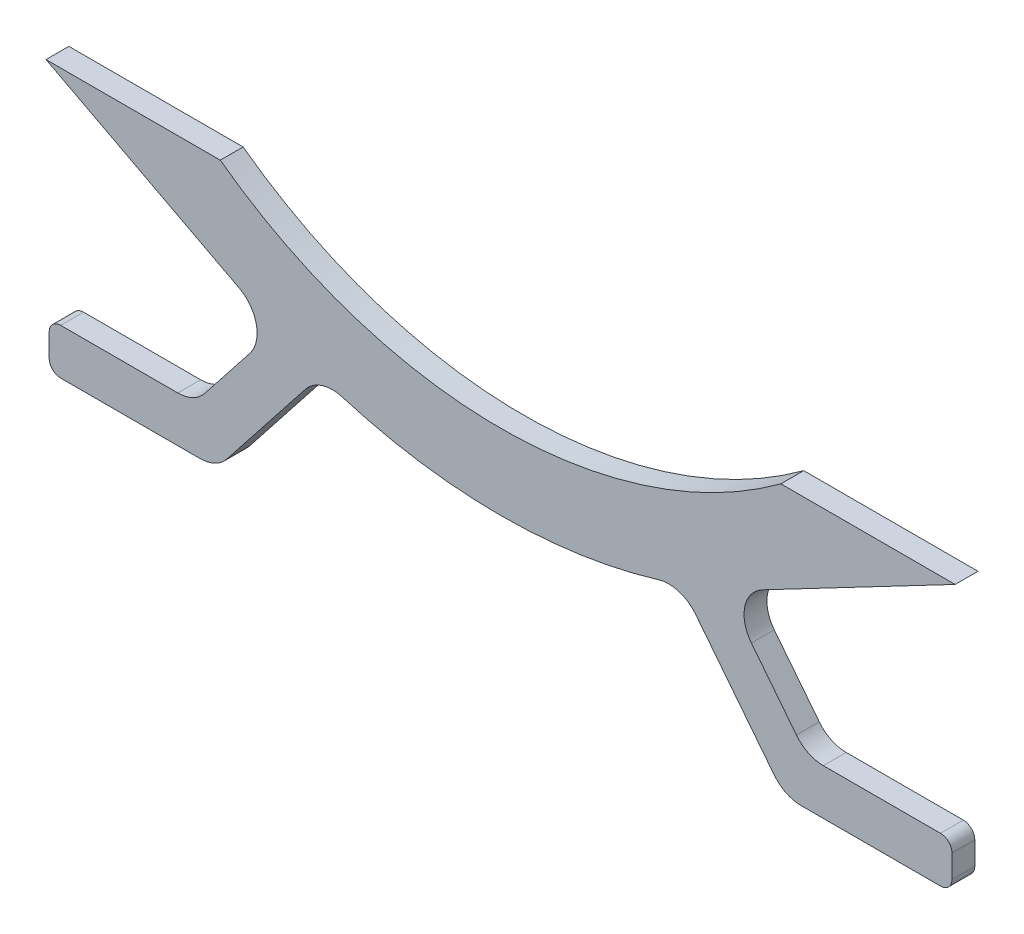
ISO-10303-21;
HEADER;
FILE_DESCRIPTION(('STEP AP214'),'2;1');
FILE_NAME('part.step','',(''),(''),'','','');
FILE_SCHEMA(('AUTOMOTIVE_DESIGN { 1 0 10303 214 1 1 1 1 }'));
ENDSEC;
DATA;
#1=APPLICATION_CONTEXT('core data for automotive mechanical design processes');
#2=APPLICATION_PROTOCOL_DEFINITION('international standard','automotive_design',2000,#1);
#3=PRODUCT_CONTEXT('',#1,'mechanical');
#4=PRODUCT('Part','Part','',(#3));
#5=PRODUCT_RELATED_PRODUCT_CATEGORY('part','',(#4));
#6=PRODUCT_DEFINITION_FORMATION('','',#4);
#7=PRODUCT_DEFINITION_CONTEXT('part definition',#1,'design');
#8=PRODUCT_DEFINITION('design','',#6,#7);
#9=PRODUCT_DEFINITION_SHAPE('','',#8);
#10=(LENGTH_UNIT() NAMED_UNIT(*) SI_UNIT(.MILLI.,.METRE.));
#11=(NAMED_UNIT(*) PLANE_ANGLE_UNIT() SI_UNIT($,.RADIAN.));
#12=(NAMED_UNIT(*) SI_UNIT($,.STERADIAN.) SOLID_ANGLE_UNIT());
#13=UNCERTAINTY_MEASURE_WITH_UNIT(LENGTH_MEASURE(1.E-05),#10,'distance_accuracy_value','');
#14=(GEOMETRIC_REPRESENTATION_CONTEXT(3) GLOBAL_UNCERTAINTY_ASSIGNED_CONTEXT((#13)) GLOBAL_UNIT_ASSIGNED_CONTEXT((#10,
#11,#12)) REPRESENTATION_CONTEXT('',''));
#15=CARTESIAN_POINT('',(0.,0.,0.));
#16=DIRECTION('',(0.,0.,1.));
#17=DIRECTION('',(1.,0.,0.));
#18=AXIS2_PLACEMENT_3D('',#15,#16,#17);
#19=CARTESIAN_POINT('',(31.674047274541,-39.6707775653773,3.175));
#20=DIRECTION('',(0.,0.,-1.));
#21=DIRECTION('',(-1.,0.,0.));
#22=AXIS2_PLACEMENT_3D('',#19,#20,#21);
#23=CYLINDRICAL_SURFACE('',#22,9.525);
#24=DIRECTION('',(0.,0.,-1.));
#25=VECTOR('',#24,1.);
#26=CARTESIAN_POINT('',(36.5718227165431,-31.5014801219174,3.175));
#27=LINE('',#26,#25);
#28=CARTESIAN_POINT('',(36.5718227165431,-31.5014801219174,-3.175));
#29=VERTEX_POINT('',#28);
#30=CARTESIAN_POINT('',(36.5718227165431,-31.5014801219174,3.175));
#31=VERTEX_POINT('',#30);
#32=EDGE_CURVE('E376',#29,#31,#27,.F.);
#33=ORIENTED_EDGE('',*,*,#32,.F.);
#34=CARTESIAN_POINT('',(31.674047274541,-39.6707775653773,-3.175));
#35=DIRECTION('',(0.,0.,-1.));
#36=DIRECTION('',(-1.,0.,0.));
#37=AXIS2_PLACEMENT_3D('',#34,#35,#36);
#38=CIRCLE('',#37,9.525);
#39=CARTESIAN_POINT('',(39.1571945715694,-45.5638354754081,-3.175));
#40=VERTEX_POINT('',#39);
#41=EDGE_CURVE('E234',#40,#29,#38,.F.);
#42=ORIENTED_EDGE('',*,*,#41,.F.);
#43=DIRECTION('',(0.,0.,-1.));
#44=VECTOR('',#43,1.);
#45=CARTESIAN_POINT('',(39.1571945715694,-45.5638354754081,89.1269852469976));
#46=LINE('',#45,#44);
#47=CARTESIAN_POINT('',(39.1571945715694,-45.5638354754081,3.175));
#48=VERTEX_POINT('',#47);
#49=EDGE_CURVE('E326',#48,#40,#46,.T.);
#50=ORIENTED_EDGE('',*,*,#49,.F.);
#51=CARTESIAN_POINT('',(31.674047274541,-39.6707775653773,3.175));
#52=DIRECTION('',(0.,0.,-1.));
#53=DIRECTION('',(-1.,0.,0.));
#54=AXIS2_PLACEMENT_3D('',#51,#52,#53);
#55=CIRCLE('',#54,9.525);
#56=EDGE_CURVE('E348',#31,#48,#55,.T.);
#57=ORIENTED_EDGE('',*,*,#56,.F.);
#58=EDGE_LOOP('',(#33,#42,#50,#57));
#59=FACE_BOUND('',#58,.T.);
#60=ADVANCED_FACE('F31',(#59),#23,.F.);
#61=CARTESIAN_POINT('',(108.839,102.685380348068,3.175));
#62=DIRECTION('',(0.,0.,-1.));
#63=DIRECTION('',(-1.,0.,0.));
#64=AXIS2_PLACEMENT_3D('',#61,#62,#63);
#65=CYLINDRICAL_SURFACE('',#64,152.4);
#66=CARTESIAN_POINT('',(108.839,102.685380348068,-3.175));
#67=DIRECTION('',(0.,0.,1.));
#68=DIRECTION('',(-1.,0.,0.));
#69=AXIS2_PLACEMENT_3D('',#66,#67,#68);
#70=CIRCLE('',#69,152.4);
#71=CARTESIAN_POINT('',(64.8526697326549,-43.2288504507548,-3.175));
#72=VERTEX_POINT('',#71);
#73=CARTESIAN_POINT('',(152.825330267345,-43.2288504507548,-3.175));
#74=VERTEX_POINT('',#73);
#75=EDGE_CURVE('E226',#72,#74,#70,.T.);
#76=ORIENTED_EDGE('',*,*,#75,.T.);
#77=DIRECTION('',(0.,0.,-1.));
#78=VECTOR('',#77,1.);
#79=CARTESIAN_POINT('',(152.825330267345,-43.2288504507548,3.175));
#80=LINE('',#79,#78);
#81=CARTESIAN_POINT('',(152.825330267345,-43.2288504507548,3.175));
#82=VERTEX_POINT('',#81);
#83=EDGE_CURVE('E393',#74,#82,#80,.F.);
#84=ORIENTED_EDGE('',*,*,#83,.T.);
#85=CARTESIAN_POINT('',(108.839,102.685380348068,3.175));
#86=DIRECTION('',(0.,0.,1.));
#87=DIRECTION('',(-1.,0.,0.));
#88=AXIS2_PLACEMENT_3D('',#85,#86,#87);
#89=CIRCLE('',#88,152.4);
#90=CARTESIAN_POINT('',(64.8526697326549,-43.2288504507548,3.175));
#91=VERTEX_POINT('',#90);
#92=EDGE_CURVE('E311',#91,#82,#89,.T.);
#93=ORIENTED_EDGE('',*,*,#92,.F.);
#94=DIRECTION('',(0.,0.,-1.));
#95=VECTOR('',#94,1.);
#96=CARTESIAN_POINT('',(64.8526697326549,-43.2288504507548,3.175));
#97=LINE('',#96,#95);
#98=EDGE_CURVE('E332',#91,#72,#97,.T.);
#99=ORIENTED_EDGE('',*,*,#98,.T.);
#100=EDGE_LOOP('',(#76,#84,#93,#99));
#101=FACE_BOUND('',#100,.T.);
#102=ADVANCED_FACE('F462',(#101),#65,.T.);
#103=CARTESIAN_POINT('',(108.839,102.685380348068,3.175));
#104=DIRECTION('',(0.,0.,-1.));
#105=DIRECTION('',(-1.,0.,0.));
#106=AXIS2_PLACEMENT_3D('',#103,#104,#105);
#107=CYLINDRICAL_SURFACE('',#106,131.423524815765);
#108=CARTESIAN_POINT('',(108.839,102.685380348068,-3.175));
#109=DIRECTION('',(0.,0.,-1.));
#110=DIRECTION('',(-1.,0.,0.));
#111=AXIS2_PLACEMENT_3D('',#108,#109,#110);
#112=CIRCLE('',#111,131.423524815765);
#113=CARTESIAN_POINT('',(186.72175,-3.17499999999998,-3.175));
#114=VERTEX_POINT('',#113);
#115=CARTESIAN_POINT('',(30.95625,-3.17499999999987,-3.175));
#116=VERTEX_POINT('',#115);
#117=EDGE_CURVE('E227',#114,#116,#112,.T.);
#118=ORIENTED_EDGE('',*,*,#117,.T.);
#119=DIRECTION('',(0.,0.,-1.));
#120=VECTOR('',#119,1.);
#121=CARTESIAN_POINT('',(30.95625,-3.17499999999987,3.175));
#122=LINE('',#121,#120);
#123=CARTESIAN_POINT('',(30.95625,-3.17499999999987,3.175));
#124=VERTEX_POINT('',#123);
#125=EDGE_CURVE('E222',#124,#116,#122,.T.);
#126=ORIENTED_EDGE('',*,*,#125,.F.);
#127=CARTESIAN_POINT('',(108.839,102.685380348068,3.175));
#128=DIRECTION('',(0.,0.,-1.));
#129=DIRECTION('',(-1.,0.,0.));
#130=AXIS2_PLACEMENT_3D('',#127,#128,#129);
#131=CIRCLE('',#130,131.423524815765);
#132=CARTESIAN_POINT('',(186.72175,-3.17499999999998,3.175));
#133=VERTEX_POINT('',#132);
#134=EDGE_CURVE('E305',#133,#124,#131,.T.);
#135=ORIENTED_EDGE('',*,*,#134,.F.);
#136=DIRECTION('',(0.,0.,-1.));
#137=VECTOR('',#136,1.);
#138=CARTESIAN_POINT('',(186.72175,-3.17499999999998,3.175));
#139=LINE('',#138,#137);
#140=EDGE_CURVE('E316',#133,#114,#139,.T.);
#141=ORIENTED_EDGE('',*,*,#140,.T.);
#142=EDGE_LOOP('',(#118,#126,#135,#141));
#143=FACE_BOUND('',#142,.T.);
#144=ADVANCED_FACE('F517',(#143),#107,.F.);
#145=CARTESIAN_POINT('',(-0.793750000000012,-3.17499999999987,3.175));
#146=DIRECTION('',(0.,-1.,0.));
#147=DIRECTION('',(0.,0.,-1.));
#148=AXIS2_PLACEMENT_3D('',#145,#146,#147);
#149=PLANE('',#148);
#150=DIRECTION('',(-1.,0.,0.));
#151=VECTOR('',#150,1.);
#152=CARTESIAN_POINT('',(-0.793750000000012,-3.17499999999987,-3.175));
#153=LINE('',#152,#151);
#154=CARTESIAN_POINT('',(-17.4624999999998,-3.17499999999993,-3.175));
#155=VERTEX_POINT('',#154);
#156=EDGE_CURVE('E216',#116,#155,#153,.T.);
#157=ORIENTED_EDGE('',*,*,#156,.T.);
#158=DIRECTION('',(0.,0.,1.));
#159=VECTOR('',#158,1.);
#160=CARTESIAN_POINT('',(-17.4624999999998,-3.17499999999993,-65.8864744659022));
#161=LINE('',#160,#159);
#162=CARTESIAN_POINT('',(-17.4624999999998,-3.17499999999993,3.175));
#163=VERTEX_POINT('',#162);
#164=EDGE_CURVE('E220',#155,#163,#161,.T.);
#165=ORIENTED_EDGE('',*,*,#164,.T.);
#166=DIRECTION('',(-1.,0.,0.));
#167=VECTOR('',#166,1.);
#168=CARTESIAN_POINT('',(-0.793750000000012,-3.17499999999987,3.175));
#169=LINE('',#168,#167);
#170=EDGE_CURVE('E308',#124,#163,#169,.T.);
#171=ORIENTED_EDGE('',*,*,#170,.F.);
#172=ORIENTED_EDGE('',*,*,#125,.T.);
#173=EDGE_LOOP('',(#157,#165,#171,#172));
#174=FACE_BOUND('',#173,.T.);
#175=ADVANCED_FACE('F218',(#174),#149,.F.);
#176=CARTESIAN_POINT('',(218.47175,-3.17499999999993,3.175));
#177=DIRECTION('',(0.,-1.,0.));
#178=DIRECTION('',(1.,0.,0.));
#179=AXIS2_PLACEMENT_3D('',#176,#177,#178);
#180=PLANE('',#179);
#181=DIRECTION('',(-1.,0.,0.));
#182=VECTOR('',#181,1.);
#183=CARTESIAN_POINT('',(218.47175,-3.17499999999993,-3.175));
#184=LINE('',#183,#182);
#185=CARTESIAN_POINT('',(235.1405,-3.17499999999993,-3.175));
#186=VERTEX_POINT('',#185);
#187=EDGE_CURVE('E309',#186,#114,#184,.T.);
#188=ORIENTED_EDGE('',*,*,#187,.T.);
#189=ORIENTED_EDGE('',*,*,#140,.F.);
#190=DIRECTION('',(-1.,0.,0.));
#191=VECTOR('',#190,1.);
#192=CARTESIAN_POINT('',(218.47175,-3.17499999999993,3.175));
#193=LINE('',#192,#191);
#194=CARTESIAN_POINT('',(235.1405,-3.17499999999993,3.175));
#195=VERTEX_POINT('',#194);
#196=EDGE_CURVE('E314',#195,#133,#193,.T.);
#197=ORIENTED_EDGE('',*,*,#196,.F.);
#198=DIRECTION('',(0.,0.,1.));
#199=VECTOR('',#198,1.);
#200=CARTESIAN_POINT('',(235.1405,-3.17499999999993,-65.8864744659022));
#201=LINE('',#200,#199);
#202=EDGE_CURVE('E275',#186,#195,#201,.T.);
#203=ORIENTED_EDGE('',*,*,#202,.F.);
#204=EDGE_LOOP('',(#188,#189,#197,#203));
#205=FACE_BOUND('',#204,.T.);
#206=ADVANCED_FACE('F522',(#205),#180,.F.);
#207=CARTESIAN_POINT('',(108.839,102.685380348068,3.175));
#208=DIRECTION('',(0.,0.,-1.));
#209=DIRECTION('',(-1.,0.,0.));
#210=AXIS2_PLACEMENT_3D('',#207,#208,#209);
#211=PLANE('',#210);
#212=DIRECTION('',(0.,-1.,0.));
#213=VECTOR('',#212,1.);
#214=CARTESIAN_POINT('',(234.2515,-77.7875,3.175));
#215=LINE('',#214,#213);
#216=CARTESIAN_POINT('',(234.2515,-68.2625,3.175));
#217=VERTEX_POINT('',#216);
#218=CARTESIAN_POINT('',(234.2515,-74.6125,3.175));
#219=VERTEX_POINT('',#218);
#220=EDGE_CURVE('E256',#217,#219,#215,.T.);
#221=ORIENTED_EDGE('',*,*,#220,.F.);
#222=CARTESIAN_POINT('',(231.0765,-68.2625,3.175));
#223=DIRECTION('',(0.,0.,-1.));
#224=DIRECTION('',(-1.,0.,0.));
#225=AXIS2_PLACEMENT_3D('',#222,#223,#224);
#226=CIRCLE('',#225,3.175);
#227=CARTESIAN_POINT('',(231.0765,-65.0875,3.175));
#228=VERTEX_POINT('',#227);
#229=EDGE_CURVE('E39',#217,#228,#226,.F.);
#230=ORIENTED_EDGE('',*,*,#229,.T.);
#231=DIRECTION('',(1.,0.,0.));
#232=VECTOR('',#231,1.);
#233=CARTESIAN_POINT('',(234.2515,-65.0875,3.175));
#234=LINE('',#233,#232);
#235=CARTESIAN_POINT('',(198.518852790911,-65.0875,3.175));
#236=VERTEX_POINT('',#235);
#237=EDGE_CURVE('E253',#236,#228,#234,.T.);
#238=ORIENTED_EDGE('',*,*,#237,.F.);
#239=CARTESIAN_POINT('',(198.518852790911,-55.5625,3.175));
#240=DIRECTION('',(0.,0.,-1.));
#241=DIRECTION('',(-1.,0.,0.));
#242=AXIS2_PLACEMENT_3D('',#239,#240,#241);
#243=CIRCLE('',#242,9.525);
#244=CARTESIAN_POINT('',(191.035705493882,-61.4555579100308,3.175));
#245=VERTEX_POINT('',#244);
#246=EDGE_CURVE('E410',#236,#245,#243,.T.);
#247=ORIENTED_EDGE('',*,*,#246,.T.);
#248=DIRECTION('',(0.618693743835251,-0.785632262155215,0.));
#249=VECTOR('',#248,1.);
#250=CARTESIAN_POINT('',(193.895898433097,-65.0875,3.175));
#251=LINE('',#250,#249);
#252=CARTESIAN_POINT('',(178.530620587576,-45.576299001603,3.175));
#253=VERTEX_POINT('',#252);
#254=EDGE_CURVE('E249',#253,#245,#251,.T.);
#255=ORIENTED_EDGE('',*,*,#254,.F.);
#256=CARTESIAN_POINT('',(186.013767884604,-39.6832410915722,3.175));
#257=DIRECTION('',(0.,0.,-1.));
#258=DIRECTION('',(-1.,0.,0.));
#259=AXIS2_PLACEMENT_3D('',#256,#257,#258);
#260=CIRCLE('',#259,9.525);
#261=CARTESIAN_POINT('',(181.591309821922,-31.247158488621,3.175));
#262=VERTEX_POINT('',#261);
#263=EDGE_CURVE('E405',#253,#262,#260,.T.);
#264=ORIENTED_EDGE('',*,*,#263,.T.);
#265=DIRECTION('',(0.885677963564434,0.464300059074256,0.));
#266=VECTOR('',#265,1.);
#267=CARTESIAN_POINT('',(179.598329002916,-32.291941299152,3.175));
#268=LINE('',#267,#266);
#269=EDGE_CURVE('E258',#262,#195,#268,.T.);
#270=ORIENTED_EDGE('',*,*,#269,.T.);
#271=ORIENTED_EDGE('',*,*,#196,.T.);
#272=ORIENTED_EDGE('',*,*,#134,.T.);
#273=ORIENTED_EDGE('',*,*,#170,.T.);
#274=DIRECTION('',(-0.885677963564434,0.464300059074256,0.));
#275=VECTOR('',#274,1.);
#276=CARTESIAN_POINT('',(38.0796709970834,-32.291941299152,3.175));
#277=LINE('',#276,#275);
#278=EDGE_CURVE('E242',#31,#163,#277,.T.);
#279=ORIENTED_EDGE('',*,*,#278,.F.);
#280=ORIENTED_EDGE('',*,*,#56,.T.);
#281=DIRECTION('',(-0.618693743835251,-0.785632262155215,0.));
#282=VECTOR('',#281,1.);
#283=CARTESIAN_POINT('',(23.7821015669025,-65.0875,3.175));
#284=LINE('',#283,#282);
#285=CARTESIAN_POINT('',(26.6422945061176,-61.4555579100308,3.175));
#286=VERTEX_POINT('',#285);
#287=EDGE_CURVE('E279',#48,#286,#284,.T.);
#288=ORIENTED_EDGE('',*,*,#287,.T.);
#289=CARTESIAN_POINT('',(19.1591472090891,-55.5625,3.175));
#290=DIRECTION('',(0.,0.,-1.));
#291=DIRECTION('',(-1.,0.,0.));
#292=AXIS2_PLACEMENT_3D('',#289,#290,#291);
#293=CIRCLE('',#292,9.525);
#294=CARTESIAN_POINT('',(19.1591472090891,-65.0875,3.175));
#295=VERTEX_POINT('',#294);
#296=EDGE_CURVE('E352',#286,#295,#293,.T.);
#297=ORIENTED_EDGE('',*,*,#296,.T.);
#298=DIRECTION('',(-1.,0.,0.));
#299=VECTOR('',#298,1.);
#300=CARTESIAN_POINT('',(-16.5735000000002,-65.0875,3.175));
#301=LINE('',#300,#299);
#302=CARTESIAN_POINT('',(-13.3985000000002,-65.0875,3.175));
#303=VERTEX_POINT('',#302);
#304=EDGE_CURVE('E291',#295,#303,#301,.T.);
#305=ORIENTED_EDGE('',*,*,#304,.T.);
#306=CARTESIAN_POINT('',(-13.3985000000002,-68.2625,3.175));
#307=DIRECTION('',(0.,0.,-1.));
#308=DIRECTION('',(-1.,0.,0.));
#309=AXIS2_PLACEMENT_3D('',#306,#307,#308);
#310=CIRCLE('',#309,3.175);
#311=CARTESIAN_POINT('',(-16.5735000000002,-68.2625,3.175));
#312=VERTEX_POINT('',#311);
#313=EDGE_CURVE('E371',#303,#312,#310,.F.);
#314=ORIENTED_EDGE('',*,*,#313,.T.);
#315=DIRECTION('',(0.,-1.,0.));
#316=VECTOR('',#315,1.);
#317=CARTESIAN_POINT('',(-16.5735000000002,-77.7875,3.175));
#318=LINE('',#317,#316);
#319=CARTESIAN_POINT('',(-16.5735000000002,-74.6125,3.175));
#320=VERTEX_POINT('',#319);
#321=EDGE_CURVE('E288',#312,#320,#318,.T.);
#322=ORIENTED_EDGE('',*,*,#321,.T.);
#323=CARTESIAN_POINT('',(-13.3985000000002,-74.6125,3.175));
#324=DIRECTION('',(0.,0.,-1.));
#325=DIRECTION('',(-1.,0.,0.));
#326=AXIS2_PLACEMENT_3D('',#323,#324,#325);
#327=CIRCLE('',#326,3.175);
#328=CARTESIAN_POINT('',(-13.3985000000002,-77.7875,3.175));
#329=VERTEX_POINT('',#328);
#330=EDGE_CURVE('E369',#320,#329,#327,.F.);
#331=ORIENTED_EDGE('',*,*,#330,.T.);
#332=DIRECTION('',(1.,0.,0.));
#333=VECTOR('',#332,1.);
#334=CARTESIAN_POINT('',(-16.5735000000002,-77.7875,3.175));
#335=LINE('',#334,#333);
#336=CARTESIAN_POINT('',(25.3230863528403,-77.7875,3.175));
#337=VERTEX_POINT('',#336);
#338=EDGE_CURVE('E286',#329,#337,#335,.T.);
#339=ORIENTED_EDGE('',*,*,#338,.T.);
#340=CARTESIAN_POINT('',(25.3230863528403,-68.2625,3.175));
#341=DIRECTION('',(0.,0.,-1.));
#342=DIRECTION('',(-1.,0.,0.));
#343=AXIS2_PLACEMENT_3D('',#340,#341,#342);
#344=CIRCLE('',#343,9.525);
#345=CARTESIAN_POINT('',(32.8062336498687,-74.1555579100308,3.175));
#346=VERTEX_POINT('',#345);
#347=EDGE_CURVE('E345',#337,#346,#344,.F.);
#348=ORIENTED_EDGE('',*,*,#347,.T.);
#349=DIRECTION('',(0.618693743835251,0.785632262155215,0.));
#350=VECTOR('',#349,1.);
#351=CARTESIAN_POINT('',(29.9460407106537,-77.7875,3.175));
#352=LINE('',#351,#350);
#353=CARTESIAN_POINT('',(54.6203767939174,-46.4554319656505,3.175));
#354=VERTEX_POINT('',#353);
#355=EDGE_CURVE('E282',#346,#354,#352,.T.);
#356=ORIENTED_EDGE('',*,*,#355,.T.);
#357=CARTESIAN_POINT('',(62.1035240909458,-52.3484898756812,3.175));
#358=DIRECTION('',(0.,0.,-1.));
#359=DIRECTION('',(-1.,0.,0.));
#360=AXIS2_PLACEMENT_3D('',#357,#358,#359);
#361=CIRCLE('',#360,9.525);
#362=EDGE_CURVE('E356',#354,#91,#361,.T.);
#363=ORIENTED_EDGE('',*,*,#362,.T.);
#364=ORIENTED_EDGE('',*,*,#92,.T.);
#365=CARTESIAN_POINT('',(155.574475909054,-52.3484898756812,3.175));
#366=DIRECTION('',(0.,0.,-1.));
#367=DIRECTION('',(-1.,0.,0.));
#368=AXIS2_PLACEMENT_3D('',#365,#366,#367);
#369=CIRCLE('',#368,9.525);
#370=CARTESIAN_POINT('',(163.057623206082,-46.4554319656504,3.175));
#371=VERTEX_POINT('',#370);
#372=EDGE_CURVE('E414',#82,#371,#369,.T.);
#373=ORIENTED_EDGE('',*,*,#372,.T.);
#374=DIRECTION('',(-0.618693743835251,0.785632262155215,0.));
#375=VECTOR('',#374,1.);
#376=CARTESIAN_POINT('',(187.731959289346,-77.7875,3.175));
#377=LINE('',#376,#375);
#378=CARTESIAN_POINT('',(184.871766350131,-74.1555579100308,3.175));
#379=VERTEX_POINT('',#378);
#380=EDGE_CURVE('E246',#379,#371,#377,.T.);
#381=ORIENTED_EDGE('',*,*,#380,.F.);
#382=CARTESIAN_POINT('',(192.35491364716,-68.2625,3.175));
#383=DIRECTION('',(0.,0.,-1.));
#384=DIRECTION('',(-1.,0.,0.));
#385=AXIS2_PLACEMENT_3D('',#382,#383,#384);
#386=CIRCLE('',#385,9.525);
#387=CARTESIAN_POINT('',(192.35491364716,-77.7875,3.175));
#388=VERTEX_POINT('',#387);
#389=EDGE_CURVE('E400',#379,#388,#386,.F.);
#390=ORIENTED_EDGE('',*,*,#389,.T.);
#391=DIRECTION('',(-1.,0.,0.));
#392=VECTOR('',#391,1.);
#393=CARTESIAN_POINT('',(234.2515,-77.7875,3.175));
#394=LINE('',#393,#392);
#395=CARTESIAN_POINT('',(231.0765,-77.7875,3.175));
#396=VERTEX_POINT('',#395);
#397=EDGE_CURVE('E250',#396,#388,#394,.T.);
#398=ORIENTED_EDGE('',*,*,#397,.F.);
#399=CARTESIAN_POINT('',(231.0765,-74.6125,3.175));
#400=DIRECTION('',(0.,0.,-1.));
#401=DIRECTION('',(-1.,0.,0.));
#402=AXIS2_PLACEMENT_3D('',#399,#400,#401);
#403=CIRCLE('',#402,3.175);
#404=EDGE_CURVE('E51',#396,#219,#403,.F.);
#405=ORIENTED_EDGE('',*,*,#404,.T.);
#406=EDGE_LOOP('',(#221,#230,#238,#247,#255,#264,#270,#271,#272,#273,#279,#280,#288,#297,#305,
#314,#322,#331,#339,#348,#356,#363,#364,#373,#381,#390,#398,#405));
#407=FACE_BOUND('',#406,.T.);
#408=ADVANCED_FACE('F430',(#407),#211,.F.);
#409=CARTESIAN_POINT('',(108.839,102.685380348068,-3.175));
#410=DIRECTION('',(0.,0.,-1.));
#411=DIRECTION('',(-1.,0.,0.));
#412=AXIS2_PLACEMENT_3D('',#409,#410,#411);
#413=PLANE('',#412);
#414=DIRECTION('',(-1.,0.,0.));
#415=VECTOR('',#414,1.);
#416=CARTESIAN_POINT('',(234.2515,-65.0875,-3.175));
#417=LINE('',#416,#415);
#418=CARTESIAN_POINT('',(231.0765,-65.0875,-3.175));
#419=VERTEX_POINT('',#418);
#420=CARTESIAN_POINT('',(198.518852790911,-65.0875,-3.175));
#421=VERTEX_POINT('',#420);
#422=EDGE_CURVE('E269',#419,#421,#417,.T.);
#423=ORIENTED_EDGE('',*,*,#422,.F.);
#424=CARTESIAN_POINT('',(231.0765,-68.2625,-3.175));
#425=DIRECTION('',(0.,0.,-1.));
#426=DIRECTION('',(-1.,0.,0.));
#427=AXIS2_PLACEMENT_3D('',#424,#425,#426);
#428=CIRCLE('',#427,3.175);
#429=CARTESIAN_POINT('',(234.2515,-68.2625,-3.175));
#430=VERTEX_POINT('',#429);
#431=EDGE_CURVE('E421',#419,#430,#428,.T.);
#432=ORIENTED_EDGE('',*,*,#431,.T.);
#433=DIRECTION('',(0.,1.,0.));
#434=VECTOR('',#433,1.);
#435=CARTESIAN_POINT('',(234.2515,-77.7875,-3.175));
#436=LINE('',#435,#434);
#437=CARTESIAN_POINT('',(234.2515,-74.6125,-3.175));
#438=VERTEX_POINT('',#437);
#439=EDGE_CURVE('E237',#438,#430,#436,.T.);
#440=ORIENTED_EDGE('',*,*,#439,.F.);
#441=CARTESIAN_POINT('',(231.0765,-74.6125,-3.175));
#442=DIRECTION('',(0.,0.,-1.));
#443=DIRECTION('',(-1.,0.,0.));
#444=AXIS2_PLACEMENT_3D('',#441,#442,#443);
#445=CIRCLE('',#444,3.175);
#446=CARTESIAN_POINT('',(231.0765,-77.7875,-3.175));
#447=VERTEX_POINT('',#446);
#448=EDGE_CURVE('E419',#438,#447,#445,.T.);
#449=ORIENTED_EDGE('',*,*,#448,.T.);
#450=DIRECTION('',(1.,0.,0.));
#451=VECTOR('',#450,1.);
#452=CARTESIAN_POINT('',(234.2515,-77.7875,-3.175));
#453=LINE('',#452,#451);
#454=CARTESIAN_POINT('',(192.35491364716,-77.7875,-3.175));
#455=VERTEX_POINT('',#454);
#456=EDGE_CURVE('E261',#455,#447,#453,.T.);
#457=ORIENTED_EDGE('',*,*,#456,.F.);
#458=CARTESIAN_POINT('',(192.35491364716,-68.2625,-3.175));
#459=DIRECTION('',(0.,0.,-1.));
#460=DIRECTION('',(-1.,0.,0.));
#461=AXIS2_PLACEMENT_3D('',#458,#459,#460);
#462=CIRCLE('',#461,9.525);
#463=CARTESIAN_POINT('',(184.871766350131,-74.1555579100308,-3.175));
#464=VERTEX_POINT('',#463);
#465=EDGE_CURVE('E398',#455,#464,#462,.T.);
#466=ORIENTED_EDGE('',*,*,#465,.T.);
#467=DIRECTION('',(0.618693743835251,-0.785632262155215,0.));
#468=VECTOR('',#467,1.);
#469=CARTESIAN_POINT('',(187.731959289346,-77.7875,-3.175));
#470=LINE('',#469,#468);
#471=CARTESIAN_POINT('',(163.057623206082,-46.4554319656504,-3.175));
#472=VERTEX_POINT('',#471);
#473=EDGE_CURVE('E263',#472,#464,#470,.T.);
#474=ORIENTED_EDGE('',*,*,#473,.F.);
#475=CARTESIAN_POINT('',(155.574475909054,-52.3484898756812,-3.175));
#476=DIRECTION('',(0.,0.,-1.));
#477=DIRECTION('',(-1.,0.,0.));
#478=AXIS2_PLACEMENT_3D('',#475,#476,#477);
#479=CIRCLE('',#478,9.525);
#480=EDGE_CURVE('E412',#472,#74,#479,.F.);
#481=ORIENTED_EDGE('',*,*,#480,.T.);
#482=ORIENTED_EDGE('',*,*,#75,.F.);
#483=CARTESIAN_POINT('',(62.1035240909458,-52.3484898756812,-3.175));
#484=DIRECTION('',(0.,0.,-1.));
#485=DIRECTION('',(-1.,0.,0.));
#486=AXIS2_PLACEMENT_3D('',#483,#484,#485);
#487=CIRCLE('',#486,9.525);
#488=CARTESIAN_POINT('',(54.6203767939174,-46.4554319656505,-3.175));
#489=VERTEX_POINT('',#488);
#490=EDGE_CURVE('E354',#72,#489,#487,.F.);
#491=ORIENTED_EDGE('',*,*,#490,.T.);
#492=DIRECTION('',(-0.618693743835251,-0.785632262155215,0.));
#493=VECTOR('',#492,1.);
#494=CARTESIAN_POINT('',(29.9460407106537,-77.7875,-3.175));
#495=LINE('',#494,#493);
#496=CARTESIAN_POINT('',(32.8062336498687,-74.1555579100308,-3.175));
#497=VERTEX_POINT('',#496);
#498=EDGE_CURVE('E298',#489,#497,#495,.T.);
#499=ORIENTED_EDGE('',*,*,#498,.T.);
#500=CARTESIAN_POINT('',(25.3230863528403,-68.2625,-3.175));
#501=DIRECTION('',(0.,0.,-1.));
#502=DIRECTION('',(-1.,0.,0.));
#503=AXIS2_PLACEMENT_3D('',#500,#501,#502);
#504=CIRCLE('',#503,9.525);
#505=CARTESIAN_POINT('',(25.3230863528403,-77.7875,-3.175));
#506=VERTEX_POINT('',#505);
#507=EDGE_CURVE('E340',#497,#506,#504,.T.);
#508=ORIENTED_EDGE('',*,*,#507,.T.);
#509=DIRECTION('',(-1.,0.,0.));
#510=VECTOR('',#509,1.);
#511=CARTESIAN_POINT('',(-16.5735000000002,-77.7875,-3.175));
#512=LINE('',#511,#510);
#513=CARTESIAN_POINT('',(-13.3985000000002,-77.7875,-3.175));
#514=VERTEX_POINT('',#513);
#515=EDGE_CURVE('E283',#506,#514,#512,.T.);
#516=ORIENTED_EDGE('',*,*,#515,.T.);
#517=CARTESIAN_POINT('',(-13.3985000000002,-74.6125,-3.175));
#518=DIRECTION('',(0.,0.,-1.));
#519=DIRECTION('',(-1.,0.,0.));
#520=AXIS2_PLACEMENT_3D('',#517,#518,#519);
#521=CIRCLE('',#520,3.175);
#522=CARTESIAN_POINT('',(-16.5735000000002,-74.6125,-3.175));
#523=VERTEX_POINT('',#522);
#524=EDGE_CURVE('E363',#514,#523,#521,.T.);
#525=ORIENTED_EDGE('',*,*,#524,.T.);
#526=DIRECTION('',(0.,1.,0.));
#527=VECTOR('',#526,1.);
#528=CARTESIAN_POINT('',(-16.5735000000002,-77.7875,-3.175));
#529=LINE('',#528,#527);
#530=CARTESIAN_POINT('',(-16.5735000000002,-68.2625,-3.175));
#531=VERTEX_POINT('',#530);
#532=EDGE_CURVE('E278',#523,#531,#529,.T.);
#533=ORIENTED_EDGE('',*,*,#532,.T.);
#534=CARTESIAN_POINT('',(-13.3985000000002,-68.2625,-3.175));
#535=DIRECTION('',(0.,0.,-1.));
#536=DIRECTION('',(-1.,0.,0.));
#537=AXIS2_PLACEMENT_3D('',#534,#535,#536);
#538=CIRCLE('',#537,3.175);
#539=CARTESIAN_POINT('',(-13.3985000000002,-65.0875,-3.175));
#540=VERTEX_POINT('',#539);
#541=EDGE_CURVE('E365',#531,#540,#538,.T.);
#542=ORIENTED_EDGE('',*,*,#541,.T.);
#543=DIRECTION('',(1.,0.,0.));
#544=VECTOR('',#543,1.);
#545=CARTESIAN_POINT('',(-16.5735000000002,-65.0875,-3.175));
#546=LINE('',#545,#544);
#547=CARTESIAN_POINT('',(19.1591472090891,-65.0875,-3.175));
#548=VERTEX_POINT('',#547);
#549=EDGE_CURVE('E294',#540,#548,#546,.T.);
#550=ORIENTED_EDGE('',*,*,#549,.T.);
#551=CARTESIAN_POINT('',(19.1591472090891,-55.5625,-3.175));
#552=DIRECTION('',(0.,0.,-1.));
#553=DIRECTION('',(-1.,0.,0.));
#554=AXIS2_PLACEMENT_3D('',#551,#552,#553);
#555=CIRCLE('',#554,9.525);
#556=CARTESIAN_POINT('',(26.6422945061176,-61.4555579100308,-3.175));
#557=VERTEX_POINT('',#556);
#558=EDGE_CURVE('E350',#548,#557,#555,.F.);
#559=ORIENTED_EDGE('',*,*,#558,.T.);
#560=DIRECTION('',(0.618693743835251,0.785632262155215,0.));
#561=VECTOR('',#560,1.);
#562=CARTESIAN_POINT('',(23.7821015669025,-65.0875,-3.175));
#563=LINE('',#562,#561);
#564=EDGE_CURVE('E296',#557,#40,#563,.T.);
#565=ORIENTED_EDGE('',*,*,#564,.T.);
#566=ORIENTED_EDGE('',*,*,#41,.T.);
#567=DIRECTION('',(-0.885677963564434,0.464300059074256,0.));
#568=VECTOR('',#567,1.);
#569=CARTESIAN_POINT('',(38.0796709970834,-32.291941299152,-3.175));
#570=LINE('',#569,#568);
#571=EDGE_CURVE('E230',#29,#155,#570,.T.);
#572=ORIENTED_EDGE('',*,*,#571,.T.);
#573=ORIENTED_EDGE('',*,*,#156,.F.);
#574=ORIENTED_EDGE('',*,*,#117,.F.);
#575=ORIENTED_EDGE('',*,*,#187,.F.);
#576=DIRECTION('',(0.885677963564434,0.464300059074256,0.));
#577=VECTOR('',#576,1.);
#578=CARTESIAN_POINT('',(179.598329002916,-32.291941299152,-3.175));
#579=LINE('',#578,#577);
#580=CARTESIAN_POINT('',(181.591309821922,-31.247158488621,-3.175));
#581=VERTEX_POINT('',#580);
#582=EDGE_CURVE('E273',#581,#186,#579,.T.);
#583=ORIENTED_EDGE('',*,*,#582,.F.);
#584=CARTESIAN_POINT('',(186.013767884604,-39.6832410915722,-3.175));
#585=DIRECTION('',(0.,0.,-1.));
#586=DIRECTION('',(-1.,0.,0.));
#587=AXIS2_PLACEMENT_3D('',#584,#585,#586);
#588=CIRCLE('',#587,9.525);
#589=CARTESIAN_POINT('',(178.530620587576,-45.576299001603,-3.175));
#590=VERTEX_POINT('',#589);
#591=EDGE_CURVE('E403',#581,#590,#588,.F.);
#592=ORIENTED_EDGE('',*,*,#591,.T.);
#593=DIRECTION('',(-0.618693743835251,0.785632262155215,0.));
#594=VECTOR('',#593,1.);
#595=CARTESIAN_POINT('',(193.895898433097,-65.0875,-3.175));
#596=LINE('',#595,#594);
#597=CARTESIAN_POINT('',(191.035705493882,-61.4555579100308,-3.175));
#598=VERTEX_POINT('',#597);
#599=EDGE_CURVE('E266',#598,#590,#596,.T.);
#600=ORIENTED_EDGE('',*,*,#599,.F.);
#601=CARTESIAN_POINT('',(198.518852790911,-55.5625,-3.175));
#602=DIRECTION('',(0.,0.,-1.));
#603=DIRECTION('',(-1.,0.,0.));
#604=AXIS2_PLACEMENT_3D('',#601,#602,#603);
#605=CIRCLE('',#604,9.525);
#606=EDGE_CURVE('E407',#598,#421,#605,.F.);
#607=ORIENTED_EDGE('',*,*,#606,.T.);
#608=EDGE_LOOP('',(#423,#432,#440,#449,#457,#466,#474,#481,#482,#491,#499,#508,#516,#525,#533,
#542,#550,#559,#565,#566,#572,#573,#574,#575,#583,#592,#600,#607));
#609=FACE_BOUND('',#608,.T.);
#610=ADVANCED_FACE('F232',(#609),#413,.T.);
#611=CARTESIAN_POINT('',(-16.5735000000002,-77.7875,89.1269852469976));
#612=DIRECTION('',(-1.,0.,0.));
#613=DIRECTION('',(0.,0.,1.));
#614=AXIS2_PLACEMENT_3D('',#611,#612,#613);
#615=PLANE('',#614);
#616=ORIENTED_EDGE('',*,*,#321,.F.);
#617=DIRECTION('',(0.,0.,-1.));
#618=VECTOR('',#617,1.);
#619=CARTESIAN_POINT('',(-16.5735000000002,-68.2625,89.1269852469976));
#620=LINE('',#619,#618);
#621=EDGE_CURVE('E360',#312,#531,#620,.T.);
#622=ORIENTED_EDGE('',*,*,#621,.T.);
#623=ORIENTED_EDGE('',*,*,#532,.F.);
#624=DIRECTION('',(0.,0.,-1.));
#625=VECTOR('',#624,1.);
#626=CARTESIAN_POINT('',(-16.5735000000002,-74.6125,89.1269852469976));
#627=LINE('',#626,#625);
#628=EDGE_CURVE('E358',#523,#320,#627,.F.);
#629=ORIENTED_EDGE('',*,*,#628,.T.);
#630=EDGE_LOOP('',(#616,#622,#623,#629));
#631=FACE_BOUND('',#630,.T.);
#632=ADVANCED_FACE('F490',(#631),#615,.T.);
#633=CARTESIAN_POINT('',(-16.5735000000002,-77.7875,89.1269852469976));
#634=DIRECTION('',(0.,-1.,0.));
#635=DIRECTION('',(1.,0.,0.));
#636=AXIS2_PLACEMENT_3D('',#633,#634,#635);
#637=PLANE('',#636);
#638=ORIENTED_EDGE('',*,*,#338,.F.);
#639=DIRECTION('',(0.,0.,-1.));
#640=VECTOR('',#639,1.);
#641=CARTESIAN_POINT('',(-13.3985000000002,-77.7875,89.1269852469976));
#642=LINE('',#641,#640);
#643=EDGE_CURVE('E373',#329,#514,#642,.T.);
#644=ORIENTED_EDGE('',*,*,#643,.T.);
#645=ORIENTED_EDGE('',*,*,#515,.F.);
#646=DIRECTION('',(0.,0.,-1.));
#647=VECTOR('',#646,1.);
#648=CARTESIAN_POINT('',(25.3230863528403,-77.7875,89.1269852469976));
#649=LINE('',#648,#647);
#650=EDGE_CURVE('E342',#506,#337,#649,.F.);
#651=ORIENTED_EDGE('',*,*,#650,.T.);
#652=EDGE_LOOP('',(#638,#644,#645,#651));
#653=FACE_BOUND('',#652,.T.);
#654=ADVANCED_FACE('F481',(#653),#637,.T.);
#655=CARTESIAN_POINT('',(29.9460407106537,-77.7875,89.1269852469976));
#656=DIRECTION('',(0.785632262155215,-0.618693743835251,0.));
#657=DIRECTION('',(0.618693743835251,0.785632262155215,0.));
#658=AXIS2_PLACEMENT_3D('',#655,#656,#657);
#659=PLANE('',#658);
#660=ORIENTED_EDGE('',*,*,#498,.F.);
#661=DIRECTION('',(0.,0.,-1.));
#662=VECTOR('',#661,1.);
#663=CARTESIAN_POINT('',(54.6203767939174,-46.4554319656505,89.1269852469976));
#664=LINE('',#663,#662);
#665=EDGE_CURVE('E338',#489,#354,#664,.F.);
#666=ORIENTED_EDGE('',*,*,#665,.T.);
#667=ORIENTED_EDGE('',*,*,#355,.F.);
#668=DIRECTION('',(0.,0.,-1.));
#669=VECTOR('',#668,1.);
#670=CARTESIAN_POINT('',(32.8062336498687,-74.1555579100308,89.1269852469976));
#671=LINE('',#670,#669);
#672=EDGE_CURVE('E335',#346,#497,#671,.T.);
#673=ORIENTED_EDGE('',*,*,#672,.T.);
#674=EDGE_LOOP('',(#660,#666,#667,#673));
#675=FACE_BOUND('',#674,.T.);
#676=ADVANCED_FACE('F471',(#675),#659,.T.);
#677=CARTESIAN_POINT('',(23.7821015669025,-65.0875,89.1269852469976));
#678=DIRECTION('',(-0.785632262155215,0.618693743835251,0.));
#679=DIRECTION('',(-0.618693743835251,-0.785632262155215,0.));
#680=AXIS2_PLACEMENT_3D('',#677,#678,#679);
#681=PLANE('',#680);
#682=ORIENTED_EDGE('',*,*,#287,.F.);
#683=ORIENTED_EDGE('',*,*,#49,.T.);
#684=ORIENTED_EDGE('',*,*,#564,.F.);
#685=DIRECTION('',(0.,0.,-1.));
#686=VECTOR('',#685,1.);
#687=CARTESIAN_POINT('',(26.6422945061176,-61.4555579100308,3.175));
#688=LINE('',#687,#686);
#689=EDGE_CURVE('E324',#557,#286,#688,.F.);
#690=ORIENTED_EDGE('',*,*,#689,.T.);
#691=EDGE_LOOP('',(#682,#683,#684,#690));
#692=FACE_BOUND('',#691,.T.);
#693=ADVANCED_FACE('F509',(#692),#681,.T.);
#694=CARTESIAN_POINT('',(-16.5735000000002,-65.0875,89.1269852469976));
#695=DIRECTION('',(0.,1.,0.));
#696=DIRECTION('',(0.,0.,1.));
#697=AXIS2_PLACEMENT_3D('',#694,#695,#696);
#698=PLANE('',#697);
#699=ORIENTED_EDGE('',*,*,#549,.F.);
#700=DIRECTION('',(0.,0.,-1.));
#701=VECTOR('',#700,1.);
#702=CARTESIAN_POINT('',(-13.3985000000002,-65.0875,89.1269852469976));
#703=LINE('',#702,#701);
#704=EDGE_CURVE('E367',#540,#303,#703,.F.);
#705=ORIENTED_EDGE('',*,*,#704,.T.);
#706=ORIENTED_EDGE('',*,*,#304,.F.);
#707=DIRECTION('',(0.,0.,-1.));
#708=VECTOR('',#707,1.);
#709=CARTESIAN_POINT('',(19.1591472090891,-65.0875,-3.175));
#710=LINE('',#709,#708);
#711=EDGE_CURVE('E329',#295,#548,#710,.T.);
#712=ORIENTED_EDGE('',*,*,#711,.T.);
#713=EDGE_LOOP('',(#699,#705,#706,#712));
#714=FACE_BOUND('',#713,.T.);
#715=ADVANCED_FACE('F499',(#714),#698,.T.);
#716=CARTESIAN_POINT('',(179.598329002916,-32.291941299152,-65.8864744659022));
#717=DIRECTION('',(0.464300059074256,-0.885677963564434,0.));
#718=DIRECTION('',(0.885677963564434,0.464300059074256,0.));
#719=AXIS2_PLACEMENT_3D('',#716,#717,#718);
#720=PLANE('',#719);
#721=ORIENTED_EDGE('',*,*,#269,.F.);
#722=DIRECTION('',(0.,0.,-1.));
#723=VECTOR('',#722,1.);
#724=CARTESIAN_POINT('',(181.591309821922,-31.247158488621,-65.8864744659022));
#725=LINE('',#724,#723);
#726=EDGE_CURVE('E378',#262,#581,#725,.T.);
#727=ORIENTED_EDGE('',*,*,#726,.T.);
#728=ORIENTED_EDGE('',*,*,#582,.T.);
#729=ORIENTED_EDGE('',*,*,#202,.T.);
#730=EDGE_LOOP('',(#721,#727,#728,#729));
#731=FACE_BOUND('',#730,.T.);
#732=ADVANCED_FACE('F525',(#731),#720,.T.);
#733=CARTESIAN_POINT('',(19.1591472090891,-55.5625,89.1269852469976));
#734=DIRECTION('',(0.,0.,1.));
#735=DIRECTION('',(1.,0.,0.));
#736=AXIS2_PLACEMENT_3D('',#733,#734,#735);
#737=CYLINDRICAL_SURFACE('',#736,9.525);
#738=ORIENTED_EDGE('',*,*,#296,.F.);
#739=ORIENTED_EDGE('',*,*,#689,.F.);
#740=ORIENTED_EDGE('',*,*,#558,.F.);
#741=ORIENTED_EDGE('',*,*,#711,.F.);
#742=EDGE_LOOP('',(#738,#739,#740,#741));
#743=FACE_BOUND('',#742,.T.);
#744=ADVANCED_FACE('F504',(#743),#737,.F.);
#745=CARTESIAN_POINT('',(62.1035240909458,-52.3484898756812,3.175));
#746=DIRECTION('',(0.,0.,-1.));
#747=DIRECTION('',(-1.,0.,0.));
#748=AXIS2_PLACEMENT_3D('',#745,#746,#747);
#749=CYLINDRICAL_SURFACE('',#748,9.525);
#750=ORIENTED_EDGE('',*,*,#362,.F.);
#751=ORIENTED_EDGE('',*,*,#665,.F.);
#752=ORIENTED_EDGE('',*,*,#490,.F.);
#753=ORIENTED_EDGE('',*,*,#98,.F.);
#754=EDGE_LOOP('',(#750,#751,#752,#753));
#755=FACE_BOUND('',#754,.T.);
#756=ADVANCED_FACE('F467',(#755),#749,.F.);
#757=CARTESIAN_POINT('',(25.3230863528403,-68.2625,89.1269852469976));
#758=DIRECTION('',(0.,0.,-1.));
#759=DIRECTION('',(-1.,0.,0.));
#760=AXIS2_PLACEMENT_3D('',#757,#758,#759);
#761=CYLINDRICAL_SURFACE('',#760,9.525);
#762=ORIENTED_EDGE('',*,*,#347,.F.);
#763=ORIENTED_EDGE('',*,*,#650,.F.);
#764=ORIENTED_EDGE('',*,*,#507,.F.);
#765=ORIENTED_EDGE('',*,*,#672,.F.);
#766=EDGE_LOOP('',(#762,#763,#764,#765));
#767=FACE_BOUND('',#766,.T.);
#768=ADVANCED_FACE('F476',(#767),#761,.T.);
#769=CARTESIAN_POINT('',(-13.3985000000002,-68.2625,89.1269852469976));
#770=DIRECTION('',(0.,0.,-1.));
#771=DIRECTION('',(-1.,0.,0.));
#772=AXIS2_PLACEMENT_3D('',#769,#770,#771);
#773=CYLINDRICAL_SURFACE('',#772,3.175);
#774=ORIENTED_EDGE('',*,*,#313,.F.);
#775=ORIENTED_EDGE('',*,*,#704,.F.);
#776=ORIENTED_EDGE('',*,*,#541,.F.);
#777=ORIENTED_EDGE('',*,*,#621,.F.);
#778=EDGE_LOOP('',(#774,#775,#776,#777));
#779=FACE_BOUND('',#778,.T.);
#780=ADVANCED_FACE('F494',(#779),#773,.T.);
#781=CARTESIAN_POINT('',(-13.3985000000002,-74.6125,89.1269852469976));
#782=DIRECTION('',(0.,0.,-1.));
#783=DIRECTION('',(-1.,0.,0.));
#784=AXIS2_PLACEMENT_3D('',#781,#782,#783);
#785=CYLINDRICAL_SURFACE('',#784,3.175);
#786=ORIENTED_EDGE('',*,*,#330,.F.);
#787=ORIENTED_EDGE('',*,*,#628,.F.);
#788=ORIENTED_EDGE('',*,*,#524,.F.);
#789=ORIENTED_EDGE('',*,*,#643,.F.);
#790=EDGE_LOOP('',(#786,#787,#788,#789));
#791=FACE_BOUND('',#790,.T.);
#792=ADVANCED_FACE('F485',(#791),#785,.T.);
#793=CARTESIAN_POINT('',(234.2515,-77.7875,89.1269852469976));
#794=DIRECTION('',(0.,1.,0.));
#795=DIRECTION('',(-1.,0.,0.));
#796=AXIS2_PLACEMENT_3D('',#793,#794,#795);
#797=PLANE('',#796);
#798=ORIENTED_EDGE('',*,*,#456,.T.);
#799=DIRECTION('',(0.,0.,-1.));
#800=VECTOR('',#799,1.);
#801=CARTESIAN_POINT('',(231.0765,-77.7875,89.1269852469976));
#802=LINE('',#801,#800);
#803=EDGE_CURVE('E11',#447,#396,#802,.F.);
#804=ORIENTED_EDGE('',*,*,#803,.T.);
#805=ORIENTED_EDGE('',*,*,#397,.T.);
#806=DIRECTION('',(0.,0.,-1.));
#807=VECTOR('',#806,1.);
#808=CARTESIAN_POINT('',(192.35491364716,-77.7875,89.1269852469976));
#809=LINE('',#808,#807);
#810=EDGE_CURVE('E395',#388,#455,#809,.T.);
#811=ORIENTED_EDGE('',*,*,#810,.T.);
#812=EDGE_LOOP('',(#798,#804,#805,#811));
#813=FACE_BOUND('',#812,.T.);
#814=ADVANCED_FACE('F445',(#813),#797,.F.);
#815=CARTESIAN_POINT('',(187.731959289346,-77.7875,89.1269852469976));
#816=DIRECTION('',(0.785632262155215,0.618693743835251,0.));
#817=DIRECTION('',(-0.618693743835251,0.785632262155215,0.));
#818=AXIS2_PLACEMENT_3D('',#815,#816,#817);
#819=PLANE('',#818);
#820=ORIENTED_EDGE('',*,*,#380,.T.);
#821=DIRECTION('',(0.,0.,1.));
#822=VECTOR('',#821,1.);
#823=CARTESIAN_POINT('',(163.057623206082,-46.4554319656504,-3.175));
#824=LINE('',#823,#822);
#825=EDGE_CURVE('E390',#371,#472,#824,.F.);
#826=ORIENTED_EDGE('',*,*,#825,.T.);
#827=ORIENTED_EDGE('',*,*,#473,.T.);
#828=DIRECTION('',(0.,0.,-1.));
#829=VECTOR('',#828,1.);
#830=CARTESIAN_POINT('',(184.871766350131,-74.1555579100308,89.1269852469976));
#831=LINE('',#830,#829);
#832=EDGE_CURVE('E388',#464,#379,#831,.F.);
#833=ORIENTED_EDGE('',*,*,#832,.T.);
#834=EDGE_LOOP('',(#820,#826,#827,#833));
#835=FACE_BOUND('',#834,.T.);
#836=ADVANCED_FACE('F453',(#835),#819,.F.);
#837=CARTESIAN_POINT('',(193.895898433097,-65.0875,89.1269852469976));
#838=DIRECTION('',(-0.785632262155215,-0.618693743835251,0.));
#839=DIRECTION('',(0.618693743835251,-0.785632262155215,0.));
#840=AXIS2_PLACEMENT_3D('',#837,#838,#839);
#841=PLANE('',#840);
#842=ORIENTED_EDGE('',*,*,#599,.T.);
#843=DIRECTION('',(0.,0.,-1.));
#844=VECTOR('',#843,1.);
#845=CARTESIAN_POINT('',(178.530620587576,-45.576299001603,89.1269852469976));
#846=LINE('',#845,#844);
#847=EDGE_CURVE('E384',#590,#253,#846,.F.);
#848=ORIENTED_EDGE('',*,*,#847,.T.);
#849=ORIENTED_EDGE('',*,*,#254,.T.);
#850=DIRECTION('',(0.,0.,-1.));
#851=VECTOR('',#850,1.);
#852=CARTESIAN_POINT('',(191.035705493882,-61.4555579100308,-3.175));
#853=LINE('',#852,#851);
#854=EDGE_CURVE('E381',#245,#598,#853,.T.);
#855=ORIENTED_EDGE('',*,*,#854,.T.);
#856=EDGE_LOOP('',(#842,#848,#849,#855));
#857=FACE_BOUND('',#856,.T.);
#858=ADVANCED_FACE('F533',(#857),#841,.F.);
#859=CARTESIAN_POINT('',(234.2515,-65.0875,89.1269852469976));
#860=DIRECTION('',(0.,-1.,0.));
#861=DIRECTION('',(0.,0.,-1.));
#862=AXIS2_PLACEMENT_3D('',#859,#860,#861);
#863=PLANE('',#862);
#864=ORIENTED_EDGE('',*,*,#237,.T.);
#865=DIRECTION('',(0.,0.,-1.));
#866=VECTOR('',#865,1.);
#867=CARTESIAN_POINT('',(231.0765,-65.0875,89.1269852469976));
#868=LINE('',#867,#866);
#869=EDGE_CURVE('E416',#228,#419,#868,.T.);
#870=ORIENTED_EDGE('',*,*,#869,.T.);
#871=ORIENTED_EDGE('',*,*,#422,.T.);
#872=DIRECTION('',(0.,0.,-1.));
#873=VECTOR('',#872,1.);
#874=CARTESIAN_POINT('',(198.518852790911,-65.0875,3.175));
#875=LINE('',#874,#873);
#876=EDGE_CURVE('E386',#421,#236,#875,.F.);
#877=ORIENTED_EDGE('',*,*,#876,.T.);
#878=EDGE_LOOP('',(#864,#870,#871,#877));
#879=FACE_BOUND('',#878,.T.);
#880=ADVANCED_FACE('F436',(#879),#863,.F.);
#881=CARTESIAN_POINT('',(234.2515,-77.7875,89.1269852469976));
#882=DIRECTION('',(-1.,0.,0.));
#883=DIRECTION('',(0.,0.,1.));
#884=AXIS2_PLACEMENT_3D('',#881,#882,#883);
#885=PLANE('',#884);
#886=ORIENTED_EDGE('',*,*,#439,.T.);
#887=DIRECTION('',(0.,0.,-1.));
#888=VECTOR('',#887,1.);
#889=CARTESIAN_POINT('',(234.2515,-68.2625,89.1269852469976));
#890=LINE('',#889,#888);
#891=EDGE_CURVE('E426',#430,#217,#890,.F.);
#892=ORIENTED_EDGE('',*,*,#891,.T.);
#893=ORIENTED_EDGE('',*,*,#220,.T.);
#894=DIRECTION('',(0.,0.,-1.));
#895=VECTOR('',#894,1.);
#896=CARTESIAN_POINT('',(234.2515,-74.6125,89.1269852469976));
#897=LINE('',#896,#895);
#898=EDGE_CURVE('E423',#219,#438,#897,.T.);
#899=ORIENTED_EDGE('',*,*,#898,.T.);
#900=EDGE_LOOP('',(#886,#892,#893,#899));
#901=FACE_BOUND('',#900,.T.);
#902=ADVANCED_FACE('F441',(#901),#885,.F.);
#903=CARTESIAN_POINT('',(38.0796709970834,-32.291941299152,-65.8864744659022));
#904=DIRECTION('',(0.464300059074256,0.885677963564434,0.));
#905=DIRECTION('',(-0.885677963564434,0.464300059074256,0.));
#906=AXIS2_PLACEMENT_3D('',#903,#904,#905);
#907=PLANE('',#906);
#908=ORIENTED_EDGE('',*,*,#571,.F.);
#909=ORIENTED_EDGE('',*,*,#32,.T.);
#910=ORIENTED_EDGE('',*,*,#278,.T.);
#911=ORIENTED_EDGE('',*,*,#164,.F.);
#912=EDGE_LOOP('',(#908,#909,#910,#911));
#913=FACE_BOUND('',#912,.T.);
#914=ADVANCED_FACE('F240',(#913),#907,.F.);
#915=CARTESIAN_POINT('',(186.013767884604,-39.6832410915722,-65.8864744659022));
#916=DIRECTION('',(0.,0.,-1.));
#917=DIRECTION('',(-1.,0.,0.));
#918=AXIS2_PLACEMENT_3D('',#915,#916,#917);
#919=CYLINDRICAL_SURFACE('',#918,9.525);
#920=ORIENTED_EDGE('',*,*,#263,.F.);
#921=ORIENTED_EDGE('',*,*,#847,.F.);
#922=ORIENTED_EDGE('',*,*,#591,.F.);
#923=ORIENTED_EDGE('',*,*,#726,.F.);
#924=EDGE_LOOP('',(#920,#921,#922,#923));
#925=FACE_BOUND('',#924,.T.);
#926=ADVANCED_FACE('F529',(#925),#919,.F.);
#927=CARTESIAN_POINT('',(198.518852790911,-55.5625,89.1269852469976));
#928=DIRECTION('',(0.,0.,1.));
#929=DIRECTION('',(1.,0.,0.));
#930=AXIS2_PLACEMENT_3D('',#927,#928,#929);
#931=CYLINDRICAL_SURFACE('',#930,9.525);
#932=ORIENTED_EDGE('',*,*,#246,.F.);
#933=ORIENTED_EDGE('',*,*,#876,.F.);
#934=ORIENTED_EDGE('',*,*,#606,.F.);
#935=ORIENTED_EDGE('',*,*,#854,.F.);
#936=EDGE_LOOP('',(#932,#933,#934,#935));
#937=FACE_BOUND('',#936,.T.);
#938=ADVANCED_FACE('F537',(#937),#931,.F.);
#939=CARTESIAN_POINT('',(155.574475909054,-52.3484898756812,3.175));
#940=DIRECTION('',(0.,0.,-1.));
#941=DIRECTION('',(-1.,0.,0.));
#942=AXIS2_PLACEMENT_3D('',#939,#940,#941);
#943=CYLINDRICAL_SURFACE('',#942,9.525);
#944=ORIENTED_EDGE('',*,*,#372,.F.);
#945=ORIENTED_EDGE('',*,*,#83,.F.);
#946=ORIENTED_EDGE('',*,*,#480,.F.);
#947=ORIENTED_EDGE('',*,*,#825,.F.);
#948=EDGE_LOOP('',(#944,#945,#946,#947));
#949=FACE_BOUND('',#948,.T.);
#950=ADVANCED_FACE('F458',(#949),#943,.F.);
#951=CARTESIAN_POINT('',(192.35491364716,-68.2625,89.1269852469976));
#952=DIRECTION('',(0.,0.,-1.));
#953=DIRECTION('',(-1.,0.,0.));
#954=AXIS2_PLACEMENT_3D('',#951,#952,#953);
#955=CYLINDRICAL_SURFACE('',#954,9.525);
#956=ORIENTED_EDGE('',*,*,#389,.F.);
#957=ORIENTED_EDGE('',*,*,#832,.F.);
#958=ORIENTED_EDGE('',*,*,#465,.F.);
#959=ORIENTED_EDGE('',*,*,#810,.F.);
#960=EDGE_LOOP('',(#956,#957,#958,#959));
#961=FACE_BOUND('',#960,.T.);
#962=ADVANCED_FACE('F449',(#961),#955,.T.);
#963=CARTESIAN_POINT('',(231.0765,-68.2625,89.1269852469976));
#964=DIRECTION('',(0.,0.,-1.));
#965=DIRECTION('',(-1.,0.,0.));
#966=AXIS2_PLACEMENT_3D('',#963,#964,#965);
#967=CYLINDRICAL_SURFACE('',#966,3.175);
#968=ORIENTED_EDGE('',*,*,#229,.F.);
#969=ORIENTED_EDGE('',*,*,#891,.F.);
#970=ORIENTED_EDGE('',*,*,#431,.F.);
#971=ORIENTED_EDGE('',*,*,#869,.F.);
#972=EDGE_LOOP('',(#968,#969,#970,#971));
#973=FACE_BOUND('',#972,.T.);
#974=ADVANCED_FACE('F438',(#973),#967,.T.);
#975=CARTESIAN_POINT('',(231.0765,-74.6125,89.1269852469976));
#976=DIRECTION('',(0.,0.,-1.));
#977=DIRECTION('',(-1.,0.,0.));
#978=AXIS2_PLACEMENT_3D('',#975,#976,#977);
#979=CYLINDRICAL_SURFACE('',#978,3.175);
#980=ORIENTED_EDGE('',*,*,#404,.F.);
#981=ORIENTED_EDGE('',*,*,#803,.F.);
#982=ORIENTED_EDGE('',*,*,#448,.F.);
#983=ORIENTED_EDGE('',*,*,#898,.F.);
#984=EDGE_LOOP('',(#980,#981,#982,#983));
#985=FACE_BOUND('',#984,.T.);
#986=ADVANCED_FACE('F33',(#985),#979,.T.);
#987=CLOSED_SHELL('',(#60,#102,#144,#175,#206,#408,#610,#632,#654,#676,#693,#715,#732,#744,#756,
#768,#780,#792,#814,#836,#858,#880,#902,#914,#926,#938,#950,#962,#974,#986));
#988=MANIFOLD_SOLID_BREP('B2',#987);
#989=ADVANCED_BREP_SHAPE_REPRESENTATION('',(#18,#988),#14);
#990=SHAPE_DEFINITION_REPRESENTATION(#9,#989);
ENDSEC;
END-ISO-10303-21;
